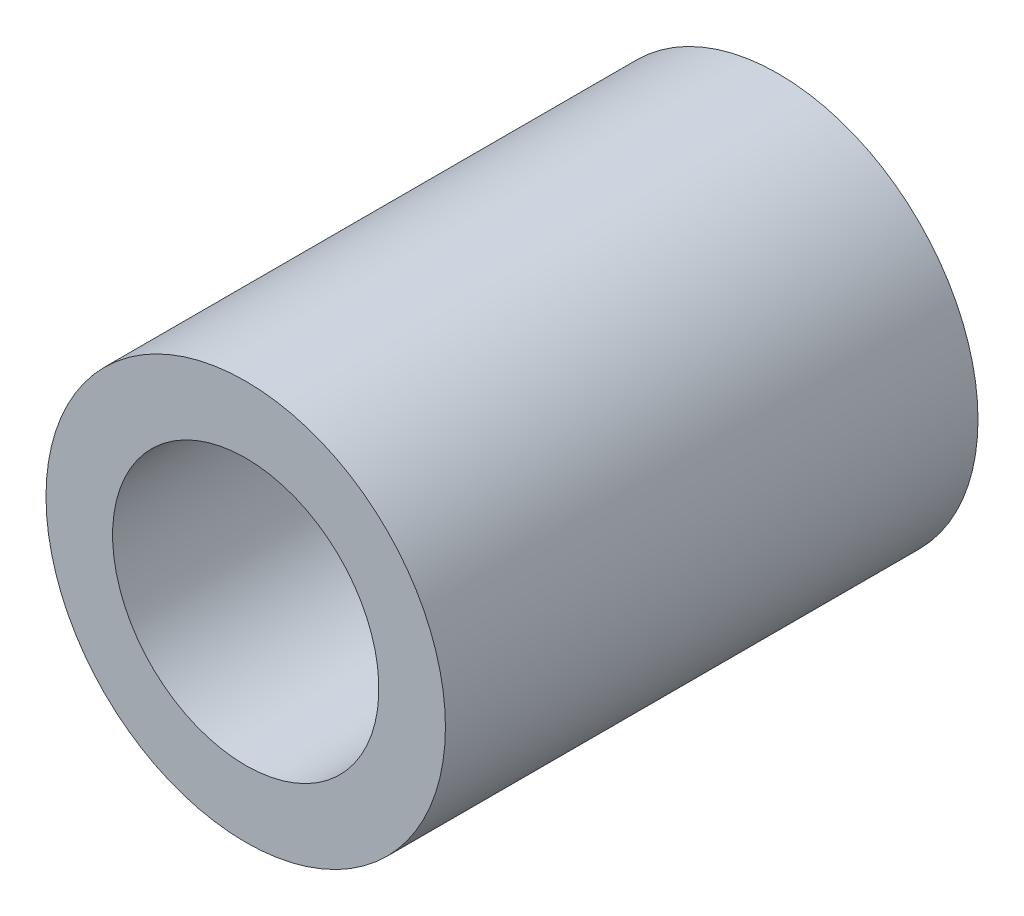
ISO-10303-21;
HEADER;
FILE_DESCRIPTION(('STEP AP214'),'2;1');
FILE_NAME('part.step','',(''),(''),'','','');
FILE_SCHEMA(('AUTOMOTIVE_DESIGN { 1 0 10303 214 1 1 1 1 }'));
ENDSEC;
DATA;
#1=APPLICATION_CONTEXT('core data for automotive mechanical design processes');
#2=APPLICATION_PROTOCOL_DEFINITION('international standard','automotive_design',2000,#1);
#3=PRODUCT_CONTEXT('',#1,'mechanical');
#4=PRODUCT('Part','Part','',(#3));
#5=PRODUCT_RELATED_PRODUCT_CATEGORY('part','',(#4));
#6=PRODUCT_DEFINITION_FORMATION('','',#4);
#7=PRODUCT_DEFINITION_CONTEXT('part definition',#1,'design');
#8=PRODUCT_DEFINITION('design','',#6,#7);
#9=PRODUCT_DEFINITION_SHAPE('','',#8);
#10=(LENGTH_UNIT() NAMED_UNIT(*) SI_UNIT(.MILLI.,.METRE.));
#11=(NAMED_UNIT(*) PLANE_ANGLE_UNIT() SI_UNIT($,.RADIAN.));
#12=(NAMED_UNIT(*) SI_UNIT($,.STERADIAN.) SOLID_ANGLE_UNIT());
#13=UNCERTAINTY_MEASURE_WITH_UNIT(LENGTH_MEASURE(1.E-05),#10,'distance_accuracy_value','');
#14=(GEOMETRIC_REPRESENTATION_CONTEXT(3) GLOBAL_UNCERTAINTY_ASSIGNED_CONTEXT((#13)) GLOBAL_UNIT_ASSIGNED_CONTEXT((#10,
#11,#12)) REPRESENTATION_CONTEXT('',''));
#15=CARTESIAN_POINT('',(0.,0.,0.));
#16=DIRECTION('',(0.,0.,1.));
#17=DIRECTION('',(1.,0.,0.));
#18=AXIS2_PLACEMENT_3D('',#15,#16,#17);
#19=CARTESIAN_POINT('',(0.,-6.35,-12.7));
#20=DIRECTION('',(0.,0.,-1.));
#21=DIRECTION('',(0.,1.,0.));
#22=AXIS2_PLACEMENT_3D('',#19,#20,#21);
#23=PLANE('',#22);
#24=CARTESIAN_POINT('',(0.,0.,-12.7));
#25=DIRECTION('',(0.,0.,1.));
#26=DIRECTION('',(0.,-1.,0.));
#27=AXIS2_PLACEMENT_3D('',#24,#25,#26);
#28=CIRCLE('',#27,6.35);
#29=CARTESIAN_POINT('',(0.,-6.35,-12.7));
#30=VERTEX_POINT('',#29);
#31=EDGE_CURVE('E10',#30,#30,#28,.T.);
#32=ORIENTED_EDGE('',*,*,#31,.T.);
#33=EDGE_LOOP('',(#32));
#34=FACE_BOUND('',#33,.T.);
#35=CARTESIAN_POINT('',(0.,0.,-12.7));
#36=DIRECTION('',(0.,0.,1.));
#37=DIRECTION('',(0.,-1.,0.));
#38=AXIS2_PLACEMENT_3D('',#35,#36,#37);
#39=CIRCLE('',#38,9.525);
#40=CARTESIAN_POINT('',(0.,-9.525,-12.7));
#41=VERTEX_POINT('',#40);
#42=EDGE_CURVE('E53',#41,#41,#39,.T.);
#43=ORIENTED_EDGE('',*,*,#42,.F.);
#44=EDGE_LOOP('',(#43));
#45=FACE_BOUND('',#44,.T.);
#46=ADVANCED_FACE('F39',(#34,#45),#23,.T.);
#47=CARTESIAN_POINT('',(0.,0.,15.18496187054));
#48=DIRECTION('',(0.,0.,1.));
#49=DIRECTION('',(0.,-1.,0.));
#50=AXIS2_PLACEMENT_3D('',#47,#48,#49);
#51=CYLINDRICAL_SURFACE('',#50,6.35);
#52=CARTESIAN_POINT('',(0.,0.,12.7));
#53=DIRECTION('',(0.,0.,1.));
#54=DIRECTION('',(0.,-1.,0.));
#55=AXIS2_PLACEMENT_3D('',#52,#53,#54);
#56=CIRCLE('',#55,6.35);
#57=CARTESIAN_POINT('',(0.,-6.35,12.7));
#58=VERTEX_POINT('',#57);
#59=EDGE_CURVE('E45',#58,#58,#56,.T.);
#60=ORIENTED_EDGE('',*,*,#59,.T.);
#61=EDGE_LOOP('',(#60));
#62=FACE_BOUND('',#61,.T.);
#63=ORIENTED_EDGE('',*,*,#31,.F.);
#64=EDGE_LOOP('',(#63));
#65=FACE_BOUND('',#64,.T.);
#66=ADVANCED_FACE('F63',(#62,#65),#51,.F.);
#67=CARTESIAN_POINT('',(0.,-6.35,12.7));
#68=DIRECTION('',(0.,0.,1.));
#69=DIRECTION('',(0.,-1.,0.));
#70=AXIS2_PLACEMENT_3D('',#67,#68,#69);
#71=PLANE('',#70);
#72=CARTESIAN_POINT('',(0.,0.,12.7));
#73=DIRECTION('',(0.,0.,1.));
#74=DIRECTION('',(0.,-1.,0.));
#75=AXIS2_PLACEMENT_3D('',#72,#73,#74);
#76=CIRCLE('',#75,9.525);
#77=CARTESIAN_POINT('',(0.,-9.525,12.7));
#78=VERTEX_POINT('',#77);
#79=EDGE_CURVE('E49',#78,#78,#76,.T.);
#80=ORIENTED_EDGE('',*,*,#79,.T.);
#81=EDGE_LOOP('',(#80));
#82=FACE_BOUND('',#81,.T.);
#83=ORIENTED_EDGE('',*,*,#59,.F.);
#84=EDGE_LOOP('',(#83));
#85=FACE_BOUND('',#84,.T.);
#86=ADVANCED_FACE('F67',(#82,#85),#71,.T.);
#87=CARTESIAN_POINT('',(0.,0.,15.18496187054));
#88=DIRECTION('',(0.,0.,1.));
#89=DIRECTION('',(0.,-1.,0.));
#90=AXIS2_PLACEMENT_3D('',#87,#88,#89);
#91=CYLINDRICAL_SURFACE('',#90,9.525);
#92=ORIENTED_EDGE('',*,*,#42,.T.);
#93=EDGE_LOOP('',(#92));
#94=FACE_BOUND('',#93,.T.);
#95=ORIENTED_EDGE('',*,*,#79,.F.);
#96=EDGE_LOOP('',(#95));
#97=FACE_BOUND('',#96,.T.);
#98=ADVANCED_FACE('F59',(#94,#97),#91,.T.);
#99=CLOSED_SHELL('',(#46,#66,#86,#98));
#100=MANIFOLD_SOLID_BREP('B2',#99);
#101=ADVANCED_BREP_SHAPE_REPRESENTATION('',(#18,#100),#14);
#102=SHAPE_DEFINITION_REPRESENTATION(#9,#101);
ENDSEC;
END-ISO-10303-21;
